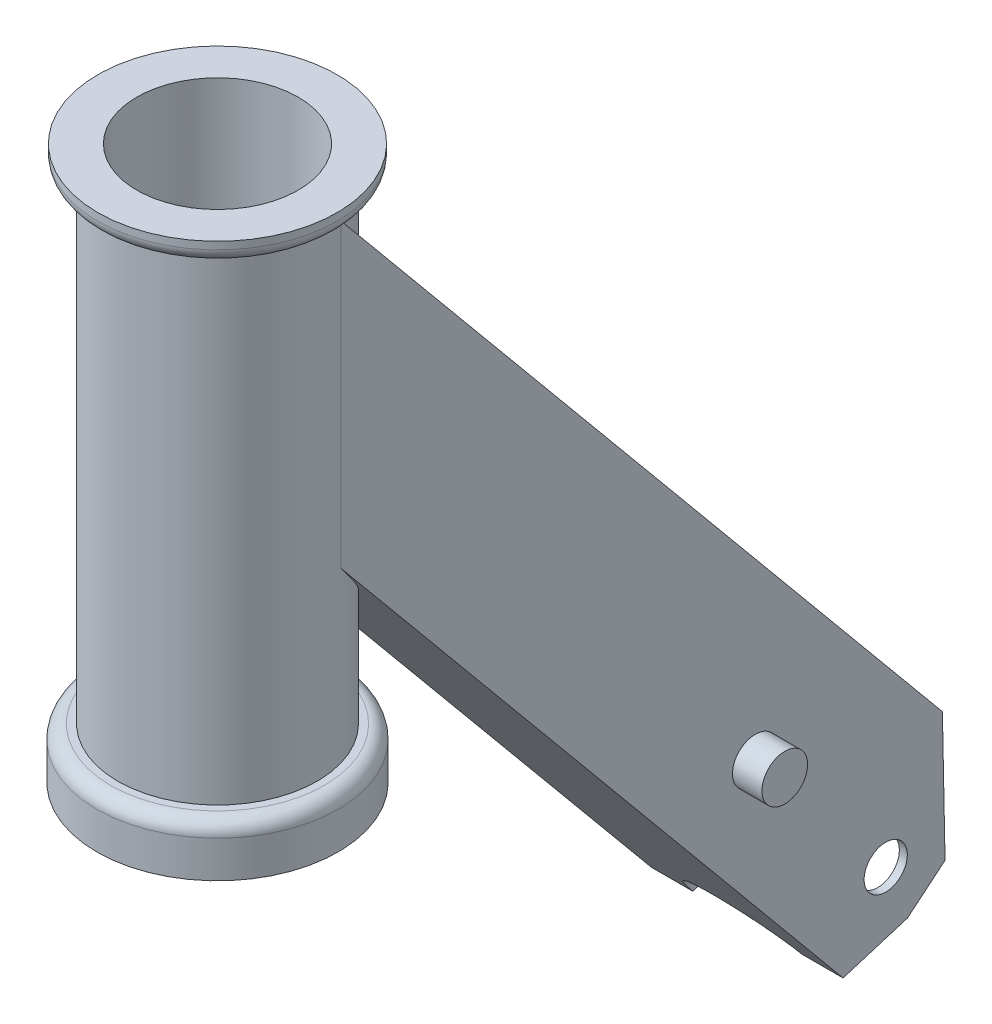
ISO-10303-21;
HEADER;
FILE_DESCRIPTION(('STEP AP214'),'2;1');
FILE_NAME('part.step','',(''),(''),'','','');
FILE_SCHEMA(('AUTOMOTIVE_DESIGN { 1 0 10303 214 1 1 1 1 }'));
ENDSEC;
DATA;
#1=APPLICATION_CONTEXT('core data for automotive mechanical design processes');
#2=APPLICATION_PROTOCOL_DEFINITION('international standard','automotive_design',2000,#1);
#3=PRODUCT_CONTEXT('',#1,'mechanical');
#4=PRODUCT('Part','Part','',(#3));
#5=PRODUCT_RELATED_PRODUCT_CATEGORY('part','',(#4));
#6=PRODUCT_DEFINITION_FORMATION('','',#4);
#7=PRODUCT_DEFINITION_CONTEXT('part definition',#1,'design');
#8=PRODUCT_DEFINITION('design','',#6,#7);
#9=PRODUCT_DEFINITION_SHAPE('','',#8);
#10=(LENGTH_UNIT() NAMED_UNIT(*) SI_UNIT(.MILLI.,.METRE.));
#11=(NAMED_UNIT(*) PLANE_ANGLE_UNIT() SI_UNIT($,.RADIAN.));
#12=(NAMED_UNIT(*) SI_UNIT($,.STERADIAN.) SOLID_ANGLE_UNIT());
#13=UNCERTAINTY_MEASURE_WITH_UNIT(LENGTH_MEASURE(1.E-05),#10,'distance_accuracy_value','');
#14=(GEOMETRIC_REPRESENTATION_CONTEXT(3) GLOBAL_UNCERTAINTY_ASSIGNED_CONTEXT((#13)) GLOBAL_UNIT_ASSIGNED_CONTEXT((#10,
#11,#12)) REPRESENTATION_CONTEXT('',''));
#15=CARTESIAN_POINT('',(0.,0.,0.));
#16=DIRECTION('',(0.,0.,1.));
#17=DIRECTION('',(1.,0.,0.));
#18=AXIS2_PLACEMENT_3D('',#15,#16,#17);
#19=CARTESIAN_POINT('',(17.5895,-103.728963419334,9.72419615617735));
#20=DIRECTION('',(-1.,0.,0.));
#21=DIRECTION('',(0.,0.,1.));
#22=AXIS2_PLACEMENT_3D('',#19,#20,#21);
#23=PLANE('',#22);
#24=DIRECTION('',(0.,0.769917595504677,0.63814331942934));
#25=VECTOR('',#24,1.);
#26=CARTESIAN_POINT('',(17.5895,97.6884,-3.31970481230389));
#27=LINE('',#26,#25);
#28=CARTESIAN_POINT('',(17.5895,-37.7445415549128,-115.572791881031));
#29=VERTEX_POINT('',#28);
#30=CARTESIAN_POINT('',(17.5895,95.5428335261872,-5.09804955939039));
#31=VERTEX_POINT('',#30);
#32=EDGE_CURVE('E231',#29,#31,#27,.T.);
#33=ORIENTED_EDGE('',*,*,#32,.T.);
#34=DIRECTION('',(0.,1.,0.));
#35=VECTOR('',#34,1.);
#36=CARTESIAN_POINT('',(17.5895,101.6,-5.09804955939038));
#37=LINE('',#36,#35);
#38=CARTESIAN_POINT('',(17.5895,40.2764083733887,-5.09804955939038));
#39=VERTEX_POINT('',#38);
#40=EDGE_CURVE('E292',#31,#39,#37,.F.);
#41=ORIENTED_EDGE('',*,*,#40,.T.);
#42=DIRECTION('',(0.,-0.769917595504677,-0.63814331942934));
#43=VECTOR('',#42,1.);
#44=CARTESIAN_POINT('',(17.5895,46.4271866374933,0.));
#45=LINE('',#44,#43);
#46=CARTESIAN_POINT('',(17.5895,-71.0023586589721,-97.3310394152556));
#47=VERTEX_POINT('',#46);
#48=EDGE_CURVE('E222',#39,#47,#45,.T.);
#49=ORIENTED_EDGE('',*,*,#48,.T.);
#50=DIRECTION('',(0.,0.292343394983634,-0.95631341066067));
#51=VECTOR('',#50,1.);
#52=CARTESIAN_POINT('',(17.5895,-67.3935548539361,-109.136154681815));
#53=LINE('',#52,#51);
#54=CARTESIAN_POINT('',(17.5895,-67.3935548539361,-109.136154681815));
#55=VERTEX_POINT('',#54);
#56=EDGE_CURVE('E224',#47,#55,#53,.T.);
#57=ORIENTED_EDGE('',*,*,#56,.T.);
#58=DIRECTION('',(0.,0.638143319429342,-0.769917595504675));
#59=VECTOR('',#58,1.);
#60=CARTESIAN_POINT('',(17.5895,-61.6556253829553,-116.058945733555));
#61=LINE('',#60,#59);
#62=CARTESIAN_POINT('',(17.5895,-61.6556253829553,-116.058945733555));
#63=VERTEX_POINT('',#62);
#64=EDGE_CURVE('E227',#55,#63,#61,.T.);
#65=ORIENTED_EDGE('',*,*,#64,.T.);
#66=DIRECTION('',(0.,0.999793374307165,0.0203275353029743));
#67=VECTOR('',#66,1.);
#68=CARTESIAN_POINT('',(17.5895,-37.7445415549128,-115.572791881031));
#69=LINE('',#68,#67);
#70=EDGE_CURVE('E229',#63,#29,#69,.T.);
#71=ORIENTED_EDGE('',*,*,#70,.T.);
#72=EDGE_LOOP('',(#33,#41,#49,#57,#65,#71));
#73=FACE_BOUND('',#72,.T.);
#74=CARTESIAN_POINT('',(17.5895,-57.2891396935477,-105.157137902319));
#75=DIRECTION('',(1.,0.,0.));
#76=DIRECTION('',(0.,0.,-1.));
#77=AXIS2_PLACEMENT_3D('',#74,#75,#76);
#78=CIRCLE('',#77,3.96875);
#79=CARTESIAN_POINT('',(17.5895,-57.2891396935477,-109.125887902319));
#80=VERTEX_POINT('',#79);
#81=EDGE_CURVE('E216',#80,#80,#78,.T.);
#82=ORIENTED_EDGE('',*,*,#81,.F.);
#83=EDGE_LOOP('',(#82));
#84=FACE_BOUND('',#83,.T.);
#85=CARTESIAN_POINT('',(17.5895,-28.3635746734894,-81.2070344289959));
#86=DIRECTION('',(-1.,0.,0.));
#87=DIRECTION('',(0.,0.,1.));
#88=AXIS2_PLACEMENT_3D('',#85,#86,#87);
#89=CIRCLE('',#88,4.19735);
#90=CARTESIAN_POINT('',(17.5895,-28.3635746734894,-77.0096844289959));
#91=VERTEX_POINT('',#90);
#92=EDGE_CURVE('E310',#91,#91,#89,.F.);
#93=ORIENTED_EDGE('',*,*,#92,.F.);
#94=EDGE_LOOP('',(#93));
#95=FACE_BOUND('',#94,.T.);
#96=ADVANCED_FACE('F34',(#73,#84,#95),#23,.F.);
#97=CARTESIAN_POINT('',(17.5895,-67.3935548539361,-109.136154681815));
#98=DIRECTION('',(0.,0.95631341066067,0.292343394983634));
#99=DIRECTION('',(0.,-0.292343394983634,0.95631341066067));
#100=AXIS2_PLACEMENT_3D('',#97,#98,#99);
#101=PLANE('',#100);
#102=DIRECTION('',(-1.,0.,0.));
#103=VECTOR('',#102,1.);
#104=CARTESIAN_POINT('',(17.5895,-71.0023586589721,-97.3310394152556));
#105=LINE('',#104,#103);
#106=CARTESIAN_POINT('',(10.0076,-71.0023586589721,-97.3310394152556));
#107=VERTEX_POINT('',#106);
#108=EDGE_CURVE('E260',#47,#107,#105,.T.);
#109=ORIENTED_EDGE('',*,*,#108,.T.);
#110=CARTESIAN_POINT('',(0.,-71.0023586589721,-97.3310394152557));
#111=DIRECTION('',(0.,0.95631341066067,0.292343394983634));
#112=DIRECTION('',(0.,-0.292343394983634,0.95631341066067));
#113=AXIS2_PLACEMENT_3D('',#110,#111,#112);
#114=ELLIPSE('',#113,25.9813025935332,10.0076);
#115=CARTESIAN_POINT('',(9.98901629563085,-70.5396915044803,-98.8445157314812));
#116=VERTEX_POINT('',#115);
#117=EDGE_CURVE('E399',#116,#107,#114,.F.);
#118=ORIENTED_EDGE('',*,*,#117,.F.);
#119=DIRECTION('',(1.,0.,0.));
#120=VECTOR('',#119,1.);
#121=CARTESIAN_POINT('',(17.5895,-70.5396915044803,-98.8445157314812));
#122=LINE('',#121,#120);
#123=CARTESIAN_POINT('',(16.129,-70.5396915044803,-98.8445157314812));
#124=VERTEX_POINT('',#123);
#125=EDGE_CURVE('E306',#116,#124,#122,.T.);
#126=ORIENTED_EDGE('',*,*,#125,.T.);
#127=DIRECTION('',(0.,0.292343394983634,-0.95631341066067));
#128=VECTOR('',#127,1.);
#129=CARTESIAN_POINT('',(16.129,-67.3935548539361,-109.136154681815));
#130=LINE('',#129,#128);
#131=CARTESIAN_POINT('',(16.129,-67.3935548539362,-109.136154681815));
#132=VERTEX_POINT('',#131);
#133=EDGE_CURVE('E205',#124,#132,#130,.T.);
#134=ORIENTED_EDGE('',*,*,#133,.T.);
#135=DIRECTION('',(-1.,0.,0.));
#136=VECTOR('',#135,1.);
#137=CARTESIAN_POINT('',(17.5895,-67.3935548539361,-109.136154681815));
#138=LINE('',#137,#136);
#139=EDGE_CURVE('E256',#55,#132,#138,.T.);
#140=ORIENTED_EDGE('',*,*,#139,.F.);
#141=ORIENTED_EDGE('',*,*,#56,.F.);
#142=EDGE_LOOP('',(#109,#118,#126,#134,#140,#141));
#143=FACE_BOUND('',#142,.T.);
#144=ADVANCED_FACE('F397',(#143),#101,.F.);
#145=CARTESIAN_POINT('',(17.5895,-37.7445415549128,-115.572791881031));
#146=DIRECTION('',(0.,-0.0203275353029743,0.999793374307165));
#147=DIRECTION('',(0.,-0.999793374307165,-0.0203275353029743));
#148=AXIS2_PLACEMENT_3D('',#145,#146,#147);
#149=PLANE('',#148);
#150=DIRECTION('',(-1.,0.,0.));
#151=VECTOR('',#150,1.);
#152=CARTESIAN_POINT('',(17.5895,-40.090765650667,-115.620494690793));
#153=LINE('',#152,#151);
#154=CARTESIAN_POINT('',(16.129,-40.090765650667,-115.620494690793));
#155=VERTEX_POINT('',#154);
#156=CARTESIAN_POINT('',(14.9225,-40.090765650667,-115.620494690793));
#157=VERTEX_POINT('',#156);
#158=EDGE_CURVE('E303',#155,#157,#153,.T.);
#159=ORIENTED_EDGE('',*,*,#158,.T.);
#160=DIRECTION('',(0.,-0.999793374307165,-0.0203275353029743));
#161=VECTOR('',#160,1.);
#162=CARTESIAN_POINT('',(14.9225,-124.841526703664,-117.343624821008));
#163=LINE('',#162,#161);
#164=CARTESIAN_POINT('',(14.9225,-37.7445415549128,-115.572791881031));
#165=VERTEX_POINT('',#164);
#166=EDGE_CURVE('E365',#165,#157,#163,.T.);
#167=ORIENTED_EDGE('',*,*,#166,.F.);
#168=DIRECTION('',(-1.,0.,0.));
#169=VECTOR('',#168,1.);
#170=CARTESIAN_POINT('',(17.5895,-37.7445415549128,-115.572791881031));
#171=LINE('',#170,#169);
#172=EDGE_CURVE('E248',#29,#165,#171,.T.);
#173=ORIENTED_EDGE('',*,*,#172,.F.);
#174=ORIENTED_EDGE('',*,*,#70,.F.);
#175=DIRECTION('',(-1.,0.,0.));
#176=VECTOR('',#175,1.);
#177=CARTESIAN_POINT('',(17.5895,-61.6556253829553,-116.058945733555));
#178=LINE('',#177,#176);
#179=CARTESIAN_POINT('',(16.129,-61.6556253829553,-116.058945733555));
#180=VERTEX_POINT('',#179);
#181=EDGE_CURVE('E252',#63,#180,#178,.T.);
#182=ORIENTED_EDGE('',*,*,#181,.T.);
#183=DIRECTION('',(0.,0.999793374307165,0.0203275353029743));
#184=VECTOR('',#183,1.);
#185=CARTESIAN_POINT('',(16.129,-37.7445415549128,-115.572791881031));
#186=LINE('',#185,#184);
#187=EDGE_CURVE('E202',#180,#155,#186,.T.);
#188=ORIENTED_EDGE('',*,*,#187,.T.);
#189=EDGE_LOOP('',(#159,#167,#173,#174,#182,#188));
#190=FACE_BOUND('',#189,.T.);
#191=ADVANCED_FACE('F364',(#190),#149,.F.);
#192=CARTESIAN_POINT('',(17.5895,-61.6556253829553,-116.058945733555));
#193=DIRECTION('',(0.,0.769917595504675,0.638143319429342));
#194=DIRECTION('',(0.,-0.638143319429342,0.769917595504675));
#195=AXIS2_PLACEMENT_3D('',#192,#193,#194);
#196=PLANE('',#195);
#197=CARTESIAN_POINT('',(-16.129,-61.6556253829553,-116.058945733555));
#198=VERTEX_POINT('',#197);
#199=CARTESIAN_POINT('',(-17.5895,-61.6556253829553,-116.058945733555));
#200=VERTEX_POINT('',#199);
#201=EDGE_CURVE('E251',#198,#200,#178,.T.);
#202=ORIENTED_EDGE('',*,*,#201,.F.);
#203=DIRECTION('',(0.,0.638143319429342,-0.769917595504675));
#204=VECTOR('',#203,1.);
#205=CARTESIAN_POINT('',(-16.129,-53.0892532772674,-126.394242543851));
#206=LINE('',#205,#204);
#207=CARTESIAN_POINT('',(-16.129,-67.3935548539362,-109.136154681815));
#208=VERTEX_POINT('',#207);
#209=EDGE_CURVE('E188',#208,#198,#206,.T.);
#210=ORIENTED_EDGE('',*,*,#209,.F.);
#211=CARTESIAN_POINT('',(-17.5895,-67.3935548539361,-109.136154681815));
#212=VERTEX_POINT('',#211);
#213=EDGE_CURVE('E255',#208,#212,#138,.T.);
#214=ORIENTED_EDGE('',*,*,#213,.T.);
#215=DIRECTION('',(0.,0.638143319429342,-0.769917595504675));
#216=VECTOR('',#215,1.);
#217=CARTESIAN_POINT('',(-17.5895,-61.6556253829553,-116.058945733555));
#218=LINE('',#217,#216);
#219=EDGE_CURVE('E240',#212,#200,#218,.T.);
#220=ORIENTED_EDGE('',*,*,#219,.T.);
#221=EDGE_LOOP('',(#202,#210,#214,#220));
#222=FACE_BOUND('',#221,.T.);
#223=ADVANCED_FACE('F345',(#222),#196,.F.);
#224=CARTESIAN_POINT('',(17.5895,-57.2891396935477,-105.157137902319));
#225=DIRECTION('',(-1.,0.,0.));
#226=DIRECTION('',(0.,0.,1.));
#227=AXIS2_PLACEMENT_3D('',#224,#225,#226);
#228=CYLINDRICAL_SURFACE('',#227,3.96875);
#229=CARTESIAN_POINT('',(-16.129,-57.2891396935477,-105.157137902319));
#230=DIRECTION('',(-1.,0.,0.));
#231=DIRECTION('',(0.,0.,1.));
#232=AXIS2_PLACEMENT_3D('',#229,#230,#231);
#233=CIRCLE('',#232,3.96875);
#234=CARTESIAN_POINT('',(-16.129,-57.2891396935477,-101.188387902319));
#235=VERTEX_POINT('',#234);
#236=EDGE_CURVE('E208',#235,#235,#233,.T.);
#237=ORIENTED_EDGE('',*,*,#236,.F.);
#238=EDGE_LOOP('',(#237));
#239=FACE_BOUND('',#238,.T.);
#240=CARTESIAN_POINT('',(-17.5895,-57.2891396935477,-105.157137902319));
#241=DIRECTION('',(1.,0.,0.));
#242=DIRECTION('',(0.,0.,-1.));
#243=AXIS2_PLACEMENT_3D('',#240,#241,#242);
#244=CIRCLE('',#243,3.96875);
#245=CARTESIAN_POINT('',(-17.5895,-57.2891396935477,-109.125887902319));
#246=VERTEX_POINT('',#245);
#247=EDGE_CURVE('E215',#246,#246,#244,.T.);
#248=ORIENTED_EDGE('',*,*,#247,.F.);
#249=EDGE_LOOP('',(#248));
#250=FACE_BOUND('',#249,.T.);
#251=ADVANCED_FACE('F469',(#239,#250),#228,.F.);
#252=CARTESIAN_POINT('',(0.,101.6,0.));
#253=DIRECTION('',(0.,1.,0.));
#254=DIRECTION('',(0.,0.,1.));
#255=AXIS2_PLACEMENT_3D('',#252,#253,#254);
#256=CYLINDRICAL_SURFACE('',#255,18.3134);
#257=CARTESIAN_POINT('',(0.,9.3218,0.));
#258=DIRECTION('',(0.,1.,0.));
#259=DIRECTION('',(0.,0.,1.));
#260=AXIS2_PLACEMENT_3D('',#257,#258,#259);
#261=CIRCLE('',#260,18.3134);
#262=CARTESIAN_POINT('',(0.,9.3218,18.3134));
#263=VERTEX_POINT('',#262);
#264=EDGE_CURVE('E275',#263,#263,#261,.T.);
#265=ORIENTED_EDGE('',*,*,#264,.T.);
#266=EDGE_LOOP('',(#265));
#267=FACE_BOUND('',#266,.T.);
#268=CARTESIAN_POINT('',(0.,97.6884,0.));
#269=DIRECTION('',(0.,1.,0.));
#270=DIRECTION('',(0.,0.,1.));
#271=AXIS2_PLACEMENT_3D('',#268,#269,#270);
#272=CIRCLE('',#271,18.3134);
#273=CARTESIAN_POINT('',(0.,97.6884,18.3134));
#274=VERTEX_POINT('',#273);
#275=EDGE_CURVE('E272',#274,#274,#272,.T.);
#276=ORIENTED_EDGE('',*,*,#275,.F.);
#277=EDGE_LOOP('',(#276));
#278=FACE_BOUND('',#277,.T.);
#279=CARTESIAN_POINT('',(0.,46.4271866374933,0.));
#280=DIRECTION('',(0.,0.63814331942934,-0.769917595504677));
#281=DIRECTION('',(0.,0.769917595504677,0.63814331942934));
#282=AXIS2_PLACEMENT_3D('',#279,#280,#281);
#283=ELLIPSE('',#282,28.6979420490945,18.3134);
#284=CARTESIAN_POINT('',(-17.5895,40.2764083733887,-5.09804955939038));
#285=VERTEX_POINT('',#284);
#286=EDGE_CURVE('E295',#39,#285,#283,.T.);
#287=ORIENTED_EDGE('',*,*,#286,.F.);
#288=ORIENTED_EDGE('',*,*,#40,.F.);
#289=CARTESIAN_POINT('',(0.,101.693611790292,0.));
#290=DIRECTION('',(0.,-0.63814331942934,0.769917595504677));
#291=DIRECTION('',(0.,0.769917595504677,0.63814331942934));
#292=AXIS2_PLACEMENT_3D('',#289,#290,#291);
#293=ELLIPSE('',#292,28.6979420490945,18.3134);
#294=CARTESIAN_POINT('',(-17.5895,95.5428335261872,-5.09804955939039));
#295=VERTEX_POINT('',#294);
#296=EDGE_CURVE('E287',#295,#31,#293,.T.);
#297=ORIENTED_EDGE('',*,*,#296,.F.);
#298=DIRECTION('',(0.,1.,0.));
#299=VECTOR('',#298,1.);
#300=CARTESIAN_POINT('',(-17.5895,101.6,-5.09804955939038));
#301=LINE('',#300,#299);
#302=EDGE_CURVE('E290',#295,#285,#301,.F.);
#303=ORIENTED_EDGE('',*,*,#302,.T.);
#304=EDGE_LOOP('',(#287,#288,#297,#303));
#305=FACE_BOUND('',#304,.T.);
#306=ADVANCED_FACE('F355',(#267,#278,#305),#256,.T.);
#307=CARTESIAN_POINT('',(0.,0.,0.));
#308=DIRECTION('',(0.,1.,0.));
#309=DIRECTION('',(0.,0.,1.));
#310=AXIS2_PLACEMENT_3D('',#307,#308,#309);
#311=PLANE('',#310);
#312=CARTESIAN_POINT('',(0.,0.,0.));
#313=DIRECTION('',(0.,-1.,0.));
#314=DIRECTION('',(0.,0.,-1.));
#315=AXIS2_PLACEMENT_3D('',#312,#313,#314);
#316=CIRCLE('',#315,14.8209);
#317=CARTESIAN_POINT('',(0.,0.,-14.8209));
#318=VERTEX_POINT('',#317);
#319=EDGE_CURVE('E493',#318,#318,#316,.T.);
#320=ORIENTED_EDGE('',*,*,#319,.F.);
#321=EDGE_LOOP('',(#320));
#322=FACE_BOUND('',#321,.T.);
#323=CARTESIAN_POINT('',(0.,0.,0.));
#324=DIRECTION('',(0.,1.,0.));
#325=DIRECTION('',(0.,0.,1.));
#326=AXIS2_PLACEMENT_3D('',#323,#324,#325);
#327=CIRCLE('',#326,22.1742);
#328=CARTESIAN_POINT('',(0.,0.,22.1742));
#329=VERTEX_POINT('',#328);
#330=EDGE_CURVE('E284',#329,#329,#327,.T.);
#331=ORIENTED_EDGE('',*,*,#330,.F.);
#332=EDGE_LOOP('',(#331));
#333=FACE_BOUND('',#332,.T.);
#334=ADVANCED_FACE('F36',(#322,#333),#311,.F.);
#335=CARTESIAN_POINT('',(0.,101.6,0.));
#336=DIRECTION('',(0.,1.,0.));
#337=DIRECTION('',(0.,0.,1.));
#338=AXIS2_PLACEMENT_3D('',#335,#336,#337);
#339=CYLINDRICAL_SURFACE('',#338,22.1742);
#340=CARTESIAN_POINT('',(0.,6.7818,0.));
#341=DIRECTION('',(0.,1.,0.));
#342=DIRECTION('',(0.,0.,1.));
#343=AXIS2_PLACEMENT_3D('',#340,#341,#342);
#344=CIRCLE('',#343,22.1742);
#345=CARTESIAN_POINT('',(0.,6.7818,22.1742));
#346=VERTEX_POINT('',#345);
#347=EDGE_CURVE('E281',#346,#346,#344,.T.);
#348=ORIENTED_EDGE('',*,*,#347,.F.);
#349=EDGE_LOOP('',(#348));
#350=FACE_BOUND('',#349,.T.);
#351=ORIENTED_EDGE('',*,*,#330,.T.);
#352=EDGE_LOOP('',(#351));
#353=FACE_BOUND('',#352,.T.);
#354=ADVANCED_FACE('F476',(#350,#353),#339,.T.);
#355=CARTESIAN_POINT('',(0.,6.7818,0.));
#356=DIRECTION('',(0.,1.,0.));
#357=DIRECTION('',(0.,0.,1.));
#358=AXIS2_PLACEMENT_3D('',#355,#356,#357);
#359=TOROIDAL_SURFACE('',#358,19.6342,2.54);
#360=CARTESIAN_POINT('',(0.,9.3218,0.));
#361=DIRECTION('',(0.,1.,0.));
#362=DIRECTION('',(0.,0.,1.));
#363=AXIS2_PLACEMENT_3D('',#360,#361,#362);
#364=CIRCLE('',#363,19.6342);
#365=CARTESIAN_POINT('',(0.,9.3218,19.6342));
#366=VERTEX_POINT('',#365);
#367=EDGE_CURVE('E278',#366,#366,#364,.T.);
#368=ORIENTED_EDGE('',*,*,#367,.F.);
#369=EDGE_LOOP('',(#368));
#370=FACE_BOUND('',#369,.T.);
#371=ORIENTED_EDGE('',*,*,#347,.T.);
#372=EDGE_LOOP('',(#371));
#373=FACE_BOUND('',#372,.T.);
#374=ADVANCED_FACE('F473',(#370,#373),#359,.T.);
#375=CARTESIAN_POINT('',(19.6342,9.3218,0.));
#376=DIRECTION('',(0.,-1.,0.));
#377=DIRECTION('',(0.,0.,-1.));
#378=AXIS2_PLACEMENT_3D('',#375,#376,#377);
#379=PLANE('',#378);
#380=ORIENTED_EDGE('',*,*,#264,.F.);
#381=EDGE_LOOP('',(#380));
#382=FACE_BOUND('',#381,.T.);
#383=ORIENTED_EDGE('',*,*,#367,.T.);
#384=EDGE_LOOP('',(#383));
#385=FACE_BOUND('',#384,.T.);
#386=ADVANCED_FACE('F465',(#382,#385),#379,.F.);
#387=CARTESIAN_POINT('',(18.3134,97.6884,0.));
#388=DIRECTION('',(0.,1.,0.));
#389=DIRECTION('',(0.,0.,1.));
#390=AXIS2_PLACEMENT_3D('',#387,#388,#389);
#391=PLANE('',#390);
#392=CARTESIAN_POINT('',(0.,97.6884,0.));
#393=DIRECTION('',(0.,1.,0.));
#394=DIRECTION('',(0.,0.,1.));
#395=AXIS2_PLACEMENT_3D('',#392,#393,#394);
#396=CIRCLE('',#395,19.431);
#397=CARTESIAN_POINT('',(0.,97.6884,19.431));
#398=VERTEX_POINT('',#397);
#399=EDGE_CURVE('E269',#398,#398,#396,.T.);
#400=ORIENTED_EDGE('',*,*,#399,.F.);
#401=EDGE_LOOP('',(#400));
#402=FACE_BOUND('',#401,.T.);
#403=ORIENTED_EDGE('',*,*,#275,.T.);
#404=EDGE_LOOP('',(#403));
#405=FACE_BOUND('',#404,.T.);
#406=ADVANCED_FACE('F461',(#402,#405),#391,.F.);
#407=CARTESIAN_POINT('',(0.,100.2284,0.));
#408=DIRECTION('',(0.,1.,0.));
#409=DIRECTION('',(0.,0.,1.));
#410=AXIS2_PLACEMENT_3D('',#407,#408,#409);
#411=TOROIDAL_SURFACE('',#410,19.431,2.54);
#412=CARTESIAN_POINT('',(0.,100.2284,0.));
#413=DIRECTION('',(0.,1.,0.));
#414=DIRECTION('',(0.,0.,1.));
#415=AXIS2_PLACEMENT_3D('',#412,#413,#414);
#416=CIRCLE('',#415,21.971);
#417=CARTESIAN_POINT('',(0.,100.2284,21.971));
#418=VERTEX_POINT('',#417);
#419=EDGE_CURVE('E266',#418,#418,#416,.T.);
#420=ORIENTED_EDGE('',*,*,#419,.F.);
#421=EDGE_LOOP('',(#420));
#422=FACE_BOUND('',#421,.T.);
#423=ORIENTED_EDGE('',*,*,#399,.T.);
#424=EDGE_LOOP('',(#423));
#425=FACE_BOUND('',#424,.T.);
#426=ADVANCED_FACE('F457',(#422,#425),#411,.T.);
#427=CARTESIAN_POINT('',(0.,101.6,0.));
#428=DIRECTION('',(0.,1.,0.));
#429=DIRECTION('',(0.,0.,1.));
#430=AXIS2_PLACEMENT_3D('',#427,#428,#429);
#431=CYLINDRICAL_SURFACE('',#430,21.971);
#432=CARTESIAN_POINT('',(0.,101.6,0.));
#433=DIRECTION('',(0.,1.,0.));
#434=DIRECTION('',(0.,0.,1.));
#435=AXIS2_PLACEMENT_3D('',#432,#433,#434);
#436=CIRCLE('',#435,21.971);
#437=CARTESIAN_POINT('',(0.,101.6,21.971));
#438=VERTEX_POINT('',#437);
#439=EDGE_CURVE('E263',#438,#438,#436,.T.);
#440=ORIENTED_EDGE('',*,*,#439,.F.);
#441=EDGE_LOOP('',(#440));
#442=FACE_BOUND('',#441,.T.);
#443=ORIENTED_EDGE('',*,*,#419,.T.);
#444=EDGE_LOOP('',(#443));
#445=FACE_BOUND('',#444,.T.);
#446=ADVANCED_FACE('F453',(#442,#445),#431,.T.);
#447=CARTESIAN_POINT('',(21.971,101.6,0.));
#448=DIRECTION('',(0.,-1.,0.));
#449=DIRECTION('',(0.,0.,-1.));
#450=AXIS2_PLACEMENT_3D('',#447,#448,#449);
#451=PLANE('',#450);
#452=CARTESIAN_POINT('',(0.,101.6,0.));
#453=DIRECTION('',(0.,-1.,0.));
#454=DIRECTION('',(0.,0.,-1.));
#455=AXIS2_PLACEMENT_3D('',#452,#453,#454);
#456=CIRCLE('',#455,14.8209);
#457=CARTESIAN_POINT('',(0.,101.6,-14.8209));
#458=VERTEX_POINT('',#457);
#459=EDGE_CURVE('E173',#458,#458,#456,.T.);
#460=ORIENTED_EDGE('',*,*,#459,.T.);
#461=EDGE_LOOP('',(#460));
#462=FACE_BOUND('',#461,.T.);
#463=ORIENTED_EDGE('',*,*,#439,.T.);
#464=EDGE_LOOP('',(#463));
#465=FACE_BOUND('',#464,.T.);
#466=ADVANCED_FACE('F321',(#462,#465),#451,.F.);
#467=CARTESIAN_POINT('',(-17.5895,-103.728963419334,9.72419615617735));
#468=DIRECTION('',(-1.,0.,0.));
#469=DIRECTION('',(0.,0.,1.));
#470=AXIS2_PLACEMENT_3D('',#467,#468,#469);
#471=PLANE('',#470);
#472=CARTESIAN_POINT('',(-17.5895,-28.3635746734894,-81.2070344289959));
#473=DIRECTION('',(-1.,0.,0.));
#474=DIRECTION('',(0.,0.,1.));
#475=AXIS2_PLACEMENT_3D('',#472,#473,#474);
#476=CIRCLE('',#475,4.19735);
#477=CARTESIAN_POINT('',(-17.5895,-28.3635746734894,-77.0096844289959));
#478=VERTEX_POINT('',#477);
#479=EDGE_CURVE('E42',#478,#478,#476,.T.);
#480=ORIENTED_EDGE('',*,*,#479,.F.);
#481=EDGE_LOOP('',(#480));
#482=FACE_BOUND('',#481,.T.);
#483=ORIENTED_EDGE('',*,*,#247,.T.);
#484=EDGE_LOOP('',(#483));
#485=FACE_BOUND('',#484,.T.);
#486=ORIENTED_EDGE('',*,*,#302,.F.);
#487=DIRECTION('',(0.,0.769917595504677,0.63814331942934));
#488=VECTOR('',#487,1.);
#489=CARTESIAN_POINT('',(-17.5895,97.6884,-3.31970481230389));
#490=LINE('',#489,#488);
#491=CARTESIAN_POINT('',(-17.5895,-37.7445415549128,-115.572791881031));
#492=VERTEX_POINT('',#491);
#493=EDGE_CURVE('E225',#492,#295,#490,.T.);
#494=ORIENTED_EDGE('',*,*,#493,.F.);
#495=DIRECTION('',(0.,0.999793374307165,0.0203275353029743));
#496=VECTOR('',#495,1.);
#497=CARTESIAN_POINT('',(-17.5895,-37.7445415549128,-115.572791881031));
#498=LINE('',#497,#496);
#499=EDGE_CURVE('E243',#200,#492,#498,.T.);
#500=ORIENTED_EDGE('',*,*,#499,.F.);
#501=ORIENTED_EDGE('',*,*,#219,.F.);
#502=DIRECTION('',(0.,0.292343394983634,-0.95631341066067));
#503=VECTOR('',#502,1.);
#504=CARTESIAN_POINT('',(-17.5895,-67.3935548539361,-109.136154681815));
#505=LINE('',#504,#503);
#506=CARTESIAN_POINT('',(-17.5895,-71.0023586589721,-97.3310394152556));
#507=VERTEX_POINT('',#506);
#508=EDGE_CURVE('E237',#507,#212,#505,.T.);
#509=ORIENTED_EDGE('',*,*,#508,.F.);
#510=DIRECTION('',(0.,-0.769917595504677,-0.63814331942934));
#511=VECTOR('',#510,1.);
#512=CARTESIAN_POINT('',(-17.5895,46.4271866374933,0.));
#513=LINE('',#512,#511);
#514=EDGE_CURVE('E219',#285,#507,#513,.T.);
#515=ORIENTED_EDGE('',*,*,#514,.F.);
#516=EDGE_LOOP('',(#486,#494,#500,#501,#509,#515));
#517=FACE_BOUND('',#516,.T.);
#518=ADVANCED_FACE('F317',(#482,#485,#517),#471,.T.);
#519=CARTESIAN_POINT('',(17.5895,46.4271866374933,0.));
#520=DIRECTION('',(0.,0.63814331942934,-0.769917595504677));
#521=DIRECTION('',(0.,0.769917595504677,0.63814331942934));
#522=AXIS2_PLACEMENT_3D('',#519,#520,#521);
#523=PLANE('',#522);
#524=CARTESIAN_POINT('',(-10.0076,-71.0023586589721,-97.3310394152556));
#525=VERTEX_POINT('',#524);
#526=EDGE_CURVE('E259',#525,#507,#105,.T.);
#527=ORIENTED_EDGE('',*,*,#526,.F.);
#528=CARTESIAN_POINT('',(0.,-71.0023586589721,-97.3310394152556));
#529=DIRECTION('',(0.,-0.63814331942934,0.769917595504677));
#530=DIRECTION('',(0.,0.769917595504677,0.63814331942934));
#531=AXIS2_PLACEMENT_3D('',#528,#529,#530);
#532=CIRCLE('',#531,10.0076);
#533=EDGE_CURVE('E408',#107,#525,#532,.T.);
#534=ORIENTED_EDGE('',*,*,#533,.F.);
#535=ORIENTED_EDGE('',*,*,#108,.F.);
#536=ORIENTED_EDGE('',*,*,#48,.F.);
#537=ORIENTED_EDGE('',*,*,#286,.T.);
#538=ORIENTED_EDGE('',*,*,#514,.T.);
#539=EDGE_LOOP('',(#527,#534,#535,#536,#537,#538));
#540=FACE_BOUND('',#539,.T.);
#541=ADVANCED_FACE('F320',(#540),#523,.F.);
#542=CARTESIAN_POINT('',(17.5895,97.6884,-3.31970481230389));
#543=DIRECTION('',(0.,-0.63814331942934,0.769917595504677));
#544=DIRECTION('',(0.,-0.769917595504677,-0.63814331942934));
#545=AXIS2_PLACEMENT_3D('',#542,#543,#544);
#546=PLANE('',#545);
#547=ORIENTED_EDGE('',*,*,#172,.T.);
#548=DIRECTION('',(0.,-0.769917595504676,-0.638143319429341));
#549=VECTOR('',#548,1.);
#550=CARTESIAN_POINT('',(14.9225,-45.5170161209302,-122.01497835488));
#551=LINE('',#550,#549);
#552=CARTESIAN_POINT('',(14.9225,-33.8431381232119,-112.339128238487));
#553=VERTEX_POINT('',#552);
#554=EDGE_CURVE('E361',#553,#165,#551,.T.);
#555=ORIENTED_EDGE('',*,*,#554,.F.);
#556=CARTESIAN_POINT('',(0.,-33.8431381232119,-112.339128238487));
#557=DIRECTION('',(0.,0.63814331942934,-0.769917595504677));
#558=DIRECTION('',(0.,-0.769917595504677,-0.63814331942934));
#559=AXIS2_PLACEMENT_3D('',#556,#557,#558);
#560=CIRCLE('',#559,14.9225);
#561=CARTESIAN_POINT('',(-14.9225,-33.8431381232119,-112.339128238487));
#562=VERTEX_POINT('',#561);
#563=EDGE_CURVE('E379',#562,#553,#560,.T.);
#564=ORIENTED_EDGE('',*,*,#563,.F.);
#565=DIRECTION('',(0.,0.769917595504676,0.638143319429341));
#566=VECTOR('',#565,1.);
#567=CARTESIAN_POINT('',(-14.9225,-33.8431381232119,-112.339128238487));
#568=LINE('',#567,#566);
#569=CARTESIAN_POINT('',(-14.9225,-37.7445415549128,-115.572791881031));
#570=VERTEX_POINT('',#569);
#571=EDGE_CURVE('E338',#570,#562,#568,.T.);
#572=ORIENTED_EDGE('',*,*,#571,.F.);
#573=EDGE_CURVE('E234',#570,#492,#171,.T.);
#574=ORIENTED_EDGE('',*,*,#573,.T.);
#575=ORIENTED_EDGE('',*,*,#493,.T.);
#576=ORIENTED_EDGE('',*,*,#296,.T.);
#577=ORIENTED_EDGE('',*,*,#32,.F.);
#578=EDGE_LOOP('',(#547,#555,#564,#572,#574,#575,#576,#577));
#579=FACE_BOUND('',#578,.T.);
#580=ADVANCED_FACE('F332',(#579),#546,.F.);
#581=CARTESIAN_POINT('',(-16.129,-70.5396915044803,-98.8445157314812));
#582=VERTEX_POINT('',#581);
#583=CARTESIAN_POINT('',(-9.98901629563086,-70.5396915044803,-98.8445157314812));
#584=VERTEX_POINT('',#583);
#585=EDGE_CURVE('E307',#582,#584,#122,.T.);
#586=ORIENTED_EDGE('',*,*,#585,.T.);
#587=EDGE_CURVE('E55',#525,#584,#114,.F.);
#588=ORIENTED_EDGE('',*,*,#587,.F.);
#589=ORIENTED_EDGE('',*,*,#526,.T.);
#590=ORIENTED_EDGE('',*,*,#508,.T.);
#591=ORIENTED_EDGE('',*,*,#213,.F.);
#592=DIRECTION('',(0.,-0.292343394983634,0.95631341066067));
#593=VECTOR('',#592,1.);
#594=CARTESIAN_POINT('',(-16.129,-67.3935548539361,-109.136154681815));
#595=LINE('',#594,#593);
#596=EDGE_CURVE('E212',#208,#582,#595,.T.);
#597=ORIENTED_EDGE('',*,*,#596,.T.);
#598=EDGE_LOOP('',(#586,#588,#589,#590,#591,#597));
#599=FACE_BOUND('',#598,.T.);
#600=ADVANCED_FACE('F349',(#599),#101,.F.);
#601=ORIENTED_EDGE('',*,*,#139,.T.);
#602=DIRECTION('',(0.,-0.638143319429342,0.769917595504675));
#603=VECTOR('',#602,1.);
#604=CARTESIAN_POINT('',(16.129,-53.0892532772674,-126.394242543851));
#605=LINE('',#604,#603);
#606=EDGE_CURVE('E190',#180,#132,#605,.T.);
#607=ORIENTED_EDGE('',*,*,#606,.F.);
#608=ORIENTED_EDGE('',*,*,#181,.F.);
#609=ORIENTED_EDGE('',*,*,#64,.F.);
#610=EDGE_LOOP('',(#601,#607,#608,#609));
#611=FACE_BOUND('',#610,.T.);
#612=ADVANCED_FACE('F444',(#611),#196,.F.);
#613=ORIENTED_EDGE('',*,*,#573,.F.);
#614=DIRECTION('',(0.,0.999793374307165,0.0203275353029743));
#615=VECTOR('',#614,1.);
#616=CARTESIAN_POINT('',(-14.9225,-112.97582690939,-117.10237454104));
#617=LINE('',#616,#615);
#618=CARTESIAN_POINT('',(-14.9225,-40.090765650667,-115.620494690793));
#619=VERTEX_POINT('',#618);
#620=EDGE_CURVE('E370',#619,#570,#617,.T.);
#621=ORIENTED_EDGE('',*,*,#620,.F.);
#622=CARTESIAN_POINT('',(-16.129,-40.090765650667,-115.620494690793));
#623=VERTEX_POINT('',#622);
#624=EDGE_CURVE('E298',#619,#623,#153,.T.);
#625=ORIENTED_EDGE('',*,*,#624,.T.);
#626=DIRECTION('',(0.,-0.999793374307165,-0.0203275353029743));
#627=VECTOR('',#626,1.);
#628=CARTESIAN_POINT('',(-16.129,-37.7445415549128,-115.572791881031));
#629=LINE('',#628,#627);
#630=EDGE_CURVE('E209',#623,#198,#629,.T.);
#631=ORIENTED_EDGE('',*,*,#630,.T.);
#632=ORIENTED_EDGE('',*,*,#201,.T.);
#633=ORIENTED_EDGE('',*,*,#499,.T.);
#634=EDGE_LOOP('',(#613,#621,#625,#631,#632,#633));
#635=FACE_BOUND('',#634,.T.);
#636=ADVANCED_FACE('F341',(#635),#149,.F.);
#637=CARTESIAN_POINT('',(16.129,-57.2891396935477,-105.157137902319));
#638=DIRECTION('',(1.,0.,0.));
#639=DIRECTION('',(0.,0.,-1.));
#640=AXIS2_PLACEMENT_3D('',#637,#638,#639);
#641=CIRCLE('',#640,3.96875);
#642=CARTESIAN_POINT('',(16.129,-57.2891396935477,-109.125887902319));
#643=VERTEX_POINT('',#642);
#644=EDGE_CURVE('E197',#643,#643,#641,.T.);
#645=ORIENTED_EDGE('',*,*,#644,.F.);
#646=EDGE_LOOP('',(#645));
#647=FACE_BOUND('',#646,.T.);
#648=ORIENTED_EDGE('',*,*,#81,.T.);
#649=EDGE_LOOP('',(#648));
#650=FACE_BOUND('',#649,.T.);
#651=ADVANCED_FACE('F438',(#647,#650),#228,.F.);
#652=CARTESIAN_POINT('',(-16.129,41.3553008419265,-6.10076982884153));
#653=DIRECTION('',(0.,-0.638143319429342,0.769917595504675));
#654=DIRECTION('',(0.,-0.769917595504675,-0.638143319429342));
#655=AXIS2_PLACEMENT_3D('',#652,#653,#654);
#656=PLANE('',#655);
#657=DIRECTION('',(-1.,0.,0.));
#658=VECTOR('',#657,1.);
#659=CARTESIAN_POINT('',(-16.129,41.3553008419265,-6.10076982884153));
#660=LINE('',#659,#658);
#661=CARTESIAN_POINT('',(-13.5070235176184,41.3553008419265,-6.10076982884153));
#662=VERTEX_POINT('',#661);
#663=CARTESIAN_POINT('',(-16.129,41.3553008419265,-6.10076982884153));
#664=VERTEX_POINT('',#663);
#665=EDGE_CURVE('E171',#662,#664,#660,.T.);
#666=ORIENTED_EDGE('',*,*,#665,.F.);
#667=CARTESIAN_POINT('',(0.,48.7158574666507,0.));
#668=DIRECTION('',(0.,-0.638143319429342,0.769917595504675));
#669=DIRECTION('',(0.,-0.769917595504675,-0.638143319429342));
#670=AXIS2_PLACEMENT_3D('',#667,#668,#669);
#671=ELLIPSE('',#670,23.2250335445861,14.8209);
#672=CARTESIAN_POINT('',(13.5070235176184,41.3553008419265,-6.10076982884153));
#673=VERTEX_POINT('',#672);
#674=EDGE_CURVE('E48',#662,#673,#671,.T.);
#675=ORIENTED_EDGE('',*,*,#674,.T.);
#676=CARTESIAN_POINT('',(16.129,41.3553008419265,-6.10076982884153));
#677=VERTEX_POINT('',#676);
#678=EDGE_CURVE('E169',#677,#673,#660,.T.);
#679=ORIENTED_EDGE('',*,*,#678,.F.);
#680=DIRECTION('',(0.,-0.769917595504675,-0.638143319429342));
#681=VECTOR('',#680,1.);
#682=CARTESIAN_POINT('',(16.129,41.3553008419265,-6.10076982884153));
#683=LINE('',#682,#681);
#684=EDGE_CURVE('E198',#677,#124,#683,.T.);
#685=ORIENTED_EDGE('',*,*,#684,.T.);
#686=ORIENTED_EDGE('',*,*,#125,.F.);
#687=CARTESIAN_POINT('',(0.,-70.0703503409456,-98.4555040634902));
#688=DIRECTION('',(0.,-0.638143319429342,0.769917595504675));
#689=DIRECTION('',(0.,-0.769917595504675,-0.638143319429342));
#690=AXIS2_PLACEMENT_3D('',#687,#688,#689);
#691=CIRCLE('',#690,10.0076);
#692=EDGE_CURVE('E394',#584,#116,#691,.F.);
#693=ORIENTED_EDGE('',*,*,#692,.F.);
#694=ORIENTED_EDGE('',*,*,#585,.F.);
#695=DIRECTION('',(0.,-0.769917595504675,-0.638143319429342));
#696=VECTOR('',#695,1.);
#697=CARTESIAN_POINT('',(-16.129,41.3553008419265,-6.10076982884153));
#698=LINE('',#697,#696);
#699=EDGE_CURVE('E194',#664,#582,#698,.T.);
#700=ORIENTED_EDGE('',*,*,#699,.F.);
#701=EDGE_LOOP('',(#666,#675,#679,#685,#686,#693,#694,#700));
#702=FACE_BOUND('',#701,.T.);
#703=ADVANCED_FACE('F167',(#702),#656,.F.);
#704=CARTESIAN_POINT('',(-16.129,61.9972589811758,-31.0052172988721));
#705=DIRECTION('',(0.,0.638143319429342,-0.769917595504675));
#706=DIRECTION('',(0.,0.769917595504675,0.638143319429342));
#707=AXIS2_PLACEMENT_3D('',#704,#705,#706);
#708=PLANE('',#707);
#709=CARTESIAN_POINT('',(0.,-34.7751464412382,-111.214663590253));
#710=DIRECTION('',(0.,0.638143319429342,-0.769917595504675));
#711=DIRECTION('',(0.,0.769917595504675,0.638143319429342));
#712=AXIS2_PLACEMENT_3D('',#709,#710,#711);
#713=CIRCLE('',#712,14.9225);
#714=CARTESIAN_POINT('',(14.9225,-34.7751464412382,-111.214663590253));
#715=VERTEX_POINT('',#714);
#716=CARTESIAN_POINT('',(-14.9225,-34.7751464412382,-111.214663590253));
#717=VERTEX_POINT('',#716);
#718=EDGE_CURVE('E369',#715,#717,#713,.F.);
#719=ORIENTED_EDGE('',*,*,#718,.F.);
#720=DIRECTION('',(0.,0.769917595504675,0.638143319429342));
#721=VECTOR('',#720,1.);
#722=CARTESIAN_POINT('',(14.9225,-46.4490244389562,-120.890513706646));
#723=LINE('',#722,#721);
#724=EDGE_CURVE('E191',#157,#715,#723,.T.);
#725=ORIENTED_EDGE('',*,*,#724,.F.);
#726=ORIENTED_EDGE('',*,*,#158,.F.);
#727=DIRECTION('',(0.,-0.769917595504675,-0.638143319429342));
#728=VECTOR('',#727,1.);
#729=CARTESIAN_POINT('',(16.129,61.9972589811758,-31.0052172988721));
#730=LINE('',#729,#728);
#731=CARTESIAN_POINT('',(16.129,61.9972589811758,-31.0052172988721));
#732=VERTEX_POINT('',#731);
#733=EDGE_CURVE('E183',#732,#155,#730,.T.);
#734=ORIENTED_EDGE('',*,*,#733,.F.);
#735=DIRECTION('',(1.,0.,0.));
#736=VECTOR('',#735,1.);
#737=CARTESIAN_POINT('',(-16.129,61.9972589811758,-31.0052172988721));
#738=LINE('',#737,#736);
#739=CARTESIAN_POINT('',(-16.129,61.9972589811758,-31.0052172988721));
#740=VERTEX_POINT('',#739);
#741=EDGE_CURVE('E382',#740,#732,#738,.T.);
#742=ORIENTED_EDGE('',*,*,#741,.F.);
#743=DIRECTION('',(0.,-0.769917595504675,-0.638143319429342));
#744=VECTOR('',#743,1.);
#745=CARTESIAN_POINT('',(-16.129,61.9972589811758,-31.0052172988721));
#746=LINE('',#745,#744);
#747=EDGE_CURVE('E180',#740,#623,#746,.T.);
#748=ORIENTED_EDGE('',*,*,#747,.T.);
#749=ORIENTED_EDGE('',*,*,#624,.F.);
#750=DIRECTION('',(0.,-0.769917595504675,-0.638143319429342));
#751=VECTOR('',#750,1.);
#752=CARTESIAN_POINT('',(-14.9225,-34.7751464412379,-111.214663590253));
#753=LINE('',#752,#751);
#754=EDGE_CURVE('E372',#717,#619,#753,.T.);
#755=ORIENTED_EDGE('',*,*,#754,.F.);
#756=EDGE_LOOP('',(#719,#725,#726,#734,#742,#748,#749,#755));
#757=FACE_BOUND('',#756,.T.);
#758=ADVANCED_FACE('F387',(#757),#708,.F.);
#759=CARTESIAN_POINT('',(-16.129,61.9972589811758,-31.0052172988721));
#760=DIRECTION('',(-1.,0.,0.));
#761=DIRECTION('',(0.,0.,1.));
#762=AXIS2_PLACEMENT_3D('',#759,#760,#761);
#763=PLANE('',#762);
#764=ORIENTED_EDGE('',*,*,#236,.T.);
#765=EDGE_LOOP('',(#764));
#766=FACE_BOUND('',#765,.T.);
#767=ORIENTED_EDGE('',*,*,#209,.T.);
#768=ORIENTED_EDGE('',*,*,#630,.F.);
#769=ORIENTED_EDGE('',*,*,#747,.F.);
#770=DIRECTION('',(0.,0.638143319429342,-0.769917595504675));
#771=VECTOR('',#770,1.);
#772=CARTESIAN_POINT('',(-16.129,61.9972589811758,-31.0052172988721));
#773=LINE('',#772,#771);
#774=EDGE_CURVE('E193',#664,#740,#773,.T.);
#775=ORIENTED_EDGE('',*,*,#774,.F.);
#776=ORIENTED_EDGE('',*,*,#699,.T.);
#777=ORIENTED_EDGE('',*,*,#596,.F.);
#778=EDGE_LOOP('',(#767,#768,#769,#775,#776,#777));
#779=FACE_BOUND('',#778,.T.);
#780=ADVANCED_FACE('F420',(#766,#779),#763,.F.);
#781=CARTESIAN_POINT('',(16.129,61.9972589811758,-31.0052172988721));
#782=DIRECTION('',(1.,0.,0.));
#783=DIRECTION('',(0.,0.,-1.));
#784=AXIS2_PLACEMENT_3D('',#781,#782,#783);
#785=PLANE('',#784);
#786=ORIENTED_EDGE('',*,*,#644,.T.);
#787=EDGE_LOOP('',(#786));
#788=FACE_BOUND('',#787,.T.);
#789=ORIENTED_EDGE('',*,*,#684,.F.);
#790=DIRECTION('',(0.,-0.638143319429342,0.769917595504675));
#791=VECTOR('',#790,1.);
#792=CARTESIAN_POINT('',(16.129,61.9972589811758,-31.0052172988721));
#793=LINE('',#792,#791);
#794=EDGE_CURVE('E179',#732,#677,#793,.T.);
#795=ORIENTED_EDGE('',*,*,#794,.F.);
#796=ORIENTED_EDGE('',*,*,#733,.T.);
#797=ORIENTED_EDGE('',*,*,#187,.F.);
#798=ORIENTED_EDGE('',*,*,#606,.T.);
#799=ORIENTED_EDGE('',*,*,#133,.F.);
#800=EDGE_LOOP('',(#789,#795,#796,#797,#798,#799));
#801=FACE_BOUND('',#800,.T.);
#802=ADVANCED_FACE('F391',(#788,#801),#785,.F.);
#803=CARTESIAN_POINT('',(-16.129,41.3553008419265,-6.10076982884153));
#804=DIRECTION('',(0.,0.769917595504675,0.638143319429342));
#805=DIRECTION('',(0.,-0.638143319429342,0.769917595504675));
#806=AXIS2_PLACEMENT_3D('',#803,#804,#805);
#807=PLANE('',#806);
#808=ORIENTED_EDGE('',*,*,#678,.T.);
#809=CARTESIAN_POINT('',(0.,36.298700587065,0.));
#810=DIRECTION('',(0.,0.769917595504675,0.638143319429342));
#811=DIRECTION('',(0.,-0.638143319429342,0.769917595504675));
#812=AXIS2_PLACEMENT_3D('',#809,#810,#811);
#813=ELLIPSE('',#812,19.249982188399,14.8209);
#814=EDGE_CURVE('E11',#673,#662,#813,.T.);
#815=ORIENTED_EDGE('',*,*,#814,.T.);
#816=ORIENTED_EDGE('',*,*,#665,.T.);
#817=ORIENTED_EDGE('',*,*,#774,.T.);
#818=ORIENTED_EDGE('',*,*,#741,.T.);
#819=ORIENTED_EDGE('',*,*,#794,.T.);
#820=EDGE_LOOP('',(#808,#815,#816,#817,#818,#819));
#821=FACE_BOUND('',#820,.T.);
#822=ADVANCED_FACE('F176',(#821),#807,.F.);
#823=CARTESIAN_POINT('',(14.9225,-126.738937183566,-24.021025800873));
#824=DIRECTION('',(1.,0.,0.));
#825=DIRECTION('',(0.,0.,-1.));
#826=AXIS2_PLACEMENT_3D('',#823,#824,#825);
#827=PLANE('',#826);
#828=ORIENTED_EDGE('',*,*,#166,.T.);
#829=ORIENTED_EDGE('',*,*,#724,.T.);
#830=DIRECTION('',(0.,0.63814331942934,-0.769917595504677));
#831=VECTOR('',#830,1.);
#832=CARTESIAN_POINT('',(14.9225,-115.065059185848,-14.3451756844798));
#833=LINE('',#832,#831);
#834=EDGE_CURVE('E374',#715,#553,#833,.T.);
#835=ORIENTED_EDGE('',*,*,#834,.T.);
#836=ORIENTED_EDGE('',*,*,#554,.T.);
#837=EDGE_LOOP('',(#828,#829,#835,#836));
#838=FACE_BOUND('',#837,.T.);
#839=ADVANCED_FACE('F529',(#838),#827,.F.);
#840=CARTESIAN_POINT('',(-14.9225,-115.065059185848,-14.3451756844798));
#841=DIRECTION('',(-1.,0.,0.));
#842=DIRECTION('',(0.,-1.,0.));
#843=AXIS2_PLACEMENT_3D('',#840,#841,#842);
#844=PLANE('',#843);
#845=ORIENTED_EDGE('',*,*,#620,.T.);
#846=ORIENTED_EDGE('',*,*,#571,.T.);
#847=DIRECTION('',(0.,0.63814331942934,-0.769917595504677));
#848=VECTOR('',#847,1.);
#849=CARTESIAN_POINT('',(-14.9225,-115.065059185848,-14.3451756844798));
#850=LINE('',#849,#848);
#851=EDGE_CURVE('E377',#717,#562,#850,.T.);
#852=ORIENTED_EDGE('',*,*,#851,.F.);
#853=ORIENTED_EDGE('',*,*,#754,.T.);
#854=EDGE_LOOP('',(#845,#846,#852,#853));
#855=FACE_BOUND('',#854,.T.);
#856=ADVANCED_FACE('F418',(#855),#844,.F.);
#857=CARTESIAN_POINT('',(0.,-115.065059185848,-14.3451756844798));
#858=DIRECTION('',(0.,0.63814331942934,-0.769917595504677));
#859=DIRECTION('',(0.,0.769917595504677,0.63814331942934));
#860=AXIS2_PLACEMENT_3D('',#857,#858,#859);
#861=CYLINDRICAL_SURFACE('',#860,14.9225);
#862=ORIENTED_EDGE('',*,*,#718,.T.);
#863=ORIENTED_EDGE('',*,*,#851,.T.);
#864=ORIENTED_EDGE('',*,*,#563,.T.);
#865=ORIENTED_EDGE('',*,*,#834,.F.);
#866=EDGE_LOOP('',(#862,#863,#864,#865));
#867=FACE_BOUND('',#866,.T.);
#868=ADVANCED_FACE('F523',(#867),#861,.F.);
#869=CARTESIAN_POINT('',(0.,8.48821583811994,-193.236128630662));
#870=DIRECTION('',(0.,-0.63814331942934,0.769917595504677));
#871=DIRECTION('',(0.,-0.769917595504677,-0.63814331942934));
#872=AXIS2_PLACEMENT_3D('',#869,#870,#871);
#873=CYLINDRICAL_SURFACE('',#872,10.0076);
#874=ORIENTED_EDGE('',*,*,#587,.T.);
#875=ORIENTED_EDGE('',*,*,#692,.T.);
#876=ORIENTED_EDGE('',*,*,#117,.T.);
#877=ORIENTED_EDGE('',*,*,#533,.T.);
#878=EDGE_LOOP('',(#874,#875,#876,#877));
#879=FACE_BOUND('',#878,.T.);
#880=ADVANCED_FACE('F519',(#879),#873,.F.);
#881=CARTESIAN_POINT('',(22.9997,-28.3635746734894,-81.2070344289959));
#882=DIRECTION('',(-1.,0.,0.));
#883=DIRECTION('',(0.,0.,1.));
#884=AXIS2_PLACEMENT_3D('',#881,#882,#883);
#885=CYLINDRICAL_SURFACE('',#884,4.19735);
#886=CARTESIAN_POINT('',(22.9997,-28.3635746734894,-81.2070344289959));
#887=DIRECTION('',(1.,0.,0.));
#888=DIRECTION('',(0.,0.,-1.));
#889=AXIS2_PLACEMENT_3D('',#886,#887,#888);
#890=CIRCLE('',#889,4.19735);
#891=CARTESIAN_POINT('',(22.9997,-28.3635746734894,-85.4043844289959));
#892=VERTEX_POINT('',#891);
#893=EDGE_CURVE('E401',#892,#892,#890,.T.);
#894=ORIENTED_EDGE('',*,*,#893,.F.);
#895=EDGE_LOOP('',(#894));
#896=FACE_BOUND('',#895,.T.);
#897=ORIENTED_EDGE('',*,*,#92,.T.);
#898=EDGE_LOOP('',(#897));
#899=FACE_BOUND('',#898,.T.);
#900=ADVANCED_FACE('F515',(#896,#899),#885,.T.);
#901=CARTESIAN_POINT('',(22.9997,-28.3635746734894,-81.2070344289959));
#902=DIRECTION('',(1.,0.,0.));
#903=DIRECTION('',(0.,0.,-1.));
#904=AXIS2_PLACEMENT_3D('',#901,#902,#903);
#905=PLANE('',#904);
#906=ORIENTED_EDGE('',*,*,#893,.T.);
#907=EDGE_LOOP('',(#906));
#908=FACE_BOUND('',#907,.T.);
#909=ADVANCED_FACE('F510',(#908),#905,.T.);
#910=CARTESIAN_POINT('',(-22.9997,-28.3635746734894,-81.2070344289959));
#911=DIRECTION('',(1.,0.,0.));
#912=DIRECTION('',(0.,0.,-1.));
#913=AXIS2_PLACEMENT_3D('',#910,#911,#912);
#914=CYLINDRICAL_SURFACE('',#913,4.19735);
#915=CARTESIAN_POINT('',(-22.9997,-28.3635746734894,-81.2070344289959));
#916=DIRECTION('',(1.,0.,0.));
#917=DIRECTION('',(0.,0.,-1.));
#918=AXIS2_PLACEMENT_3D('',#915,#916,#917);
#919=CIRCLE('',#918,4.19735);
#920=CARTESIAN_POINT('',(-22.9997,-28.3635746734894,-85.4043844289959));
#921=VERTEX_POINT('',#920);
#922=EDGE_CURVE('E172',#921,#921,#919,.T.);
#923=ORIENTED_EDGE('',*,*,#922,.T.);
#924=EDGE_LOOP('',(#923));
#925=FACE_BOUND('',#924,.T.);
#926=ORIENTED_EDGE('',*,*,#479,.T.);
#927=EDGE_LOOP('',(#926));
#928=FACE_BOUND('',#927,.T.);
#929=ADVANCED_FACE('F315',(#925,#928),#914,.T.);
#930=CARTESIAN_POINT('',(-22.9997,-28.3635746734894,-81.2070344289959));
#931=DIRECTION('',(-1.,0.,0.));
#932=DIRECTION('',(0.,0.,-1.));
#933=AXIS2_PLACEMENT_3D('',#930,#931,#932);
#934=PLANE('',#933);
#935=ORIENTED_EDGE('',*,*,#922,.F.);
#936=EDGE_LOOP('',(#935));
#937=FACE_BOUND('',#936,.T.);
#938=ADVANCED_FACE('F502',(#937),#934,.T.);
#939=CARTESIAN_POINT('',(0.,101.6,0.));
#940=DIRECTION('',(0.,-1.,0.));
#941=DIRECTION('',(0.,0.,-1.));
#942=AXIS2_PLACEMENT_3D('',#939,#940,#941);
#943=CYLINDRICAL_SURFACE('',#942,14.8209);
#944=ORIENTED_EDGE('',*,*,#319,.T.);
#945=EDGE_LOOP('',(#944));
#946=FACE_BOUND('',#945,.T.);
#947=ORIENTED_EDGE('',*,*,#459,.F.);
#948=EDGE_LOOP('',(#947));
#949=FACE_BOUND('',#948,.T.);
#950=ORIENTED_EDGE('',*,*,#814,.F.);
#951=ORIENTED_EDGE('',*,*,#674,.F.);
#952=EDGE_LOOP('',(#950,#951));
#953=FACE_BOUND('',#952,.T.);
#954=ADVANCED_FACE('F161',(#946,#949,#953),#943,.F.);
#955=CLOSED_SHELL('',(#96,#144,#191,#223,#251,#306,#334,#354,#374,#386,#406,#426,#446,#466,#518,
#541,#580,#600,#612,#636,#651,#703,#758,#780,#802,#822,#839,#856,#868,#880,#900,#909,#929,#938,#954));
#956=MANIFOLD_SOLID_BREP('B2',#955);
#957=ADVANCED_BREP_SHAPE_REPRESENTATION('',(#18,#956),#14);
#958=SHAPE_DEFINITION_REPRESENTATION(#9,#957);
ENDSEC;
END-ISO-10303-21;
